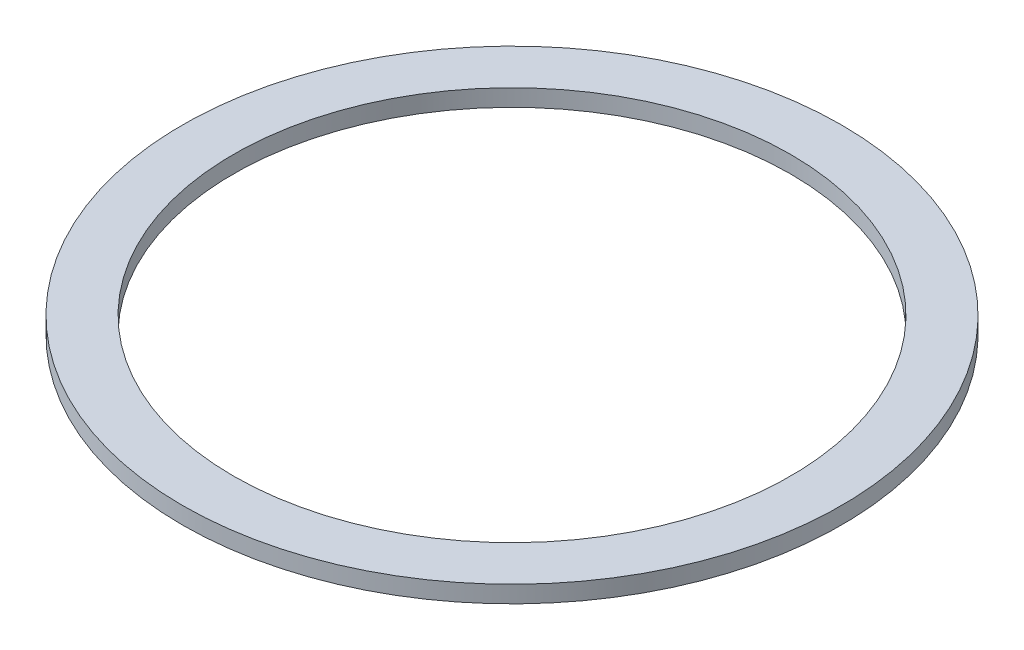
ISO-10303-21;
HEADER;
FILE_DESCRIPTION(('STEP AP214'),'2;1');
FILE_NAME('part.step','',(''),(''),'','','');
FILE_SCHEMA(('AUTOMOTIVE_DESIGN { 1 0 10303 214 1 1 1 1 }'));
ENDSEC;
DATA;
#1=APPLICATION_CONTEXT('core data for automotive mechanical design processes');
#2=APPLICATION_PROTOCOL_DEFINITION('international standard','automotive_design',2000,#1);
#3=PRODUCT_CONTEXT('',#1,'mechanical');
#4=PRODUCT('Part','Part','',(#3));
#5=PRODUCT_RELATED_PRODUCT_CATEGORY('part','',(#4));
#6=PRODUCT_DEFINITION_FORMATION('','',#4);
#7=PRODUCT_DEFINITION_CONTEXT('part definition',#1,'design');
#8=PRODUCT_DEFINITION('design','',#6,#7);
#9=PRODUCT_DEFINITION_SHAPE('','',#8);
#10=(LENGTH_UNIT() NAMED_UNIT(*) SI_UNIT(.MILLI.,.METRE.));
#11=(NAMED_UNIT(*) PLANE_ANGLE_UNIT() SI_UNIT($,.RADIAN.));
#12=(NAMED_UNIT(*) SI_UNIT($,.STERADIAN.) SOLID_ANGLE_UNIT());
#13=UNCERTAINTY_MEASURE_WITH_UNIT(LENGTH_MEASURE(1.E-05),#10,'distance_accuracy_value','');
#14=(GEOMETRIC_REPRESENTATION_CONTEXT(3) GLOBAL_UNCERTAINTY_ASSIGNED_CONTEXT((#13)) GLOBAL_UNIT_ASSIGNED_CONTEXT((#10,
#11,#12)) REPRESENTATION_CONTEXT('',''));
#15=CARTESIAN_POINT('',(0.,0.,0.));
#16=DIRECTION('',(0.,0.,1.));
#17=DIRECTION('',(1.,0.,0.));
#18=AXIS2_PLACEMENT_3D('',#15,#16,#17);
#19=CARTESIAN_POINT('',(0.,1.,0.));
#20=DIRECTION('',(0.,1.,0.));
#21=DIRECTION('',(0.,0.,1.));
#22=AXIS2_PLACEMENT_3D('',#19,#20,#21);
#23=PLANE('',#22);
#24=CARTESIAN_POINT('',(0.,1.,0.));
#25=DIRECTION('',(0.,1.,0.));
#26=DIRECTION('',(0.,0.,1.));
#27=AXIS2_PLACEMENT_3D('',#24,#25,#26);
#28=CIRCLE('',#27,19.4);
#29=CARTESIAN_POINT('',(0.,1.,19.4));
#30=VERTEX_POINT('',#29);
#31=EDGE_CURVE('E10',#30,#30,#28,.T.);
#32=ORIENTED_EDGE('',*,*,#31,.T.);
#33=EDGE_LOOP('',(#32));
#34=FACE_BOUND('',#33,.T.);
#35=CARTESIAN_POINT('',(0.,1.,0.));
#36=DIRECTION('',(0.,1.,0.));
#37=DIRECTION('',(0.,0.,1.));
#38=AXIS2_PLACEMENT_3D('',#35,#36,#37);
#39=CIRCLE('',#38,16.4);
#40=CARTESIAN_POINT('',(0.,1.,16.4));
#41=VERTEX_POINT('',#40);
#42=EDGE_CURVE('E50',#41,#41,#39,.T.);
#43=ORIENTED_EDGE('',*,*,#42,.F.);
#44=EDGE_LOOP('',(#43));
#45=FACE_BOUND('',#44,.T.);
#46=ADVANCED_FACE('F37',(#34,#45),#23,.T.);
#47=CARTESIAN_POINT('',(0.,0.,0.));
#48=DIRECTION('',(0.,1.,0.));
#49=DIRECTION('',(0.,0.,1.));
#50=AXIS2_PLACEMENT_3D('',#47,#48,#49);
#51=PLANE('',#50);
#52=CARTESIAN_POINT('',(0.,0.,0.));
#53=DIRECTION('',(0.,1.,0.));
#54=DIRECTION('',(0.,0.,1.));
#55=AXIS2_PLACEMENT_3D('',#52,#53,#54);
#56=CIRCLE('',#55,19.4);
#57=CARTESIAN_POINT('',(0.,0.,19.4));
#58=VERTEX_POINT('',#57);
#59=EDGE_CURVE('E41',#58,#58,#56,.T.);
#60=ORIENTED_EDGE('',*,*,#59,.F.);
#61=EDGE_LOOP('',(#60));
#62=FACE_BOUND('',#61,.T.);
#63=CARTESIAN_POINT('',(0.,0.,0.));
#64=DIRECTION('',(0.,1.,0.));
#65=DIRECTION('',(0.,0.,1.));
#66=AXIS2_PLACEMENT_3D('',#63,#64,#65);
#67=CIRCLE('',#66,16.4);
#68=CARTESIAN_POINT('',(0.,0.,16.4));
#69=VERTEX_POINT('',#68);
#70=EDGE_CURVE('E52',#69,#69,#67,.T.);
#71=ORIENTED_EDGE('',*,*,#70,.T.);
#72=EDGE_LOOP('',(#71));
#73=FACE_BOUND('',#72,.T.);
#74=ADVANCED_FACE('F64',(#62,#73),#51,.F.);
#75=CARTESIAN_POINT('',(0.,1.,0.));
#76=DIRECTION('',(0.,-1.,0.));
#77=DIRECTION('',(0.,0.,-1.));
#78=AXIS2_PLACEMENT_3D('',#75,#76,#77);
#79=CYLINDRICAL_SURFACE('',#78,19.4);
#80=ORIENTED_EDGE('',*,*,#31,.F.);
#81=EDGE_LOOP('',(#80));
#82=FACE_BOUND('',#81,.T.);
#83=ORIENTED_EDGE('',*,*,#59,.T.);
#84=EDGE_LOOP('',(#83));
#85=FACE_BOUND('',#84,.T.);
#86=ADVANCED_FACE('F39',(#82,#85),#79,.T.);
#87=CARTESIAN_POINT('',(0.,1.,0.));
#88=DIRECTION('',(0.,-1.,0.));
#89=DIRECTION('',(0.,0.,-1.));
#90=AXIS2_PLACEMENT_3D('',#87,#88,#89);
#91=CYLINDRICAL_SURFACE('',#90,16.4);
#92=ORIENTED_EDGE('',*,*,#42,.T.);
#93=EDGE_LOOP('',(#92));
#94=FACE_BOUND('',#93,.T.);
#95=ORIENTED_EDGE('',*,*,#70,.F.);
#96=EDGE_LOOP('',(#95));
#97=FACE_BOUND('',#96,.T.);
#98=ADVANCED_FACE('F60',(#94,#97),#91,.F.);
#99=CLOSED_SHELL('',(#46,#74,#86,#98));
#100=MANIFOLD_SOLID_BREP('B2',#99);
#101=ADVANCED_BREP_SHAPE_REPRESENTATION('',(#18,#100),#14);
#102=SHAPE_DEFINITION_REPRESENTATION(#9,#101);
ENDSEC;
END-ISO-10303-21;
